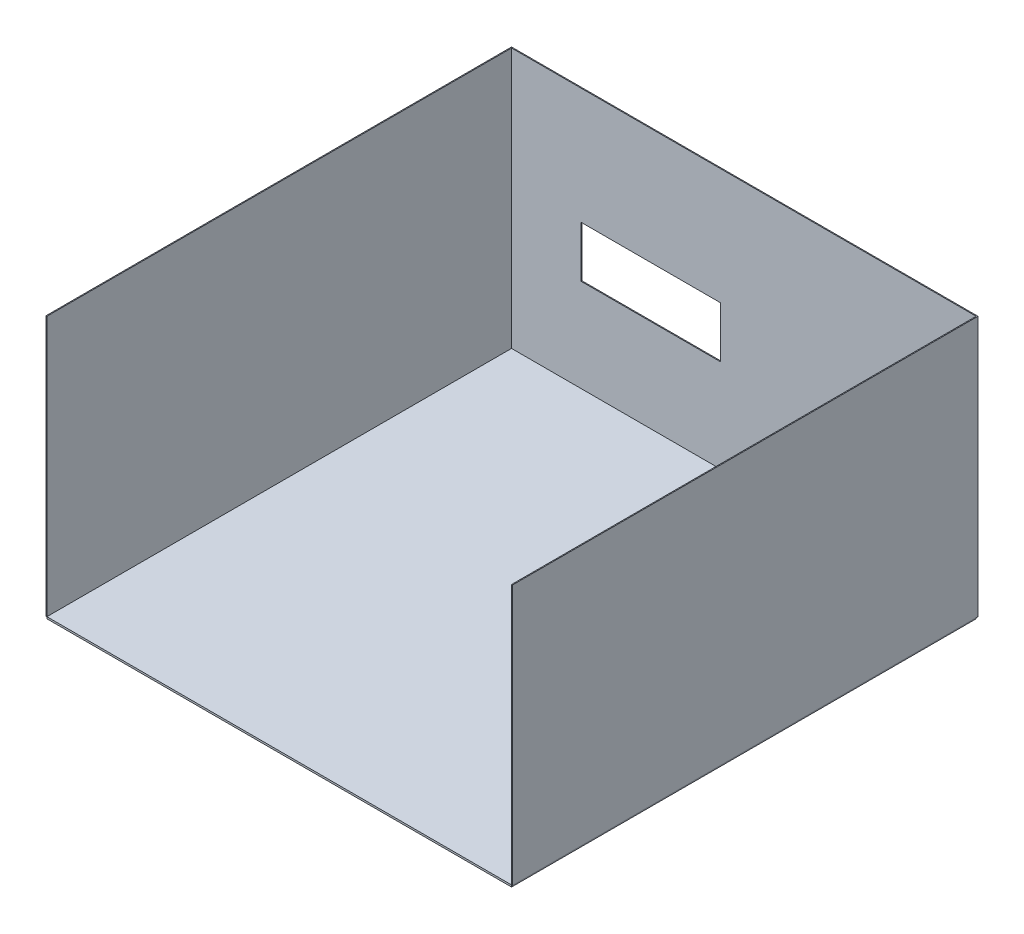
ISO-10303-21;
HEADER;
FILE_DESCRIPTION(('STEP AP214'),'2;1');
FILE_NAME('part.step','',(''),(''),'','','');
FILE_SCHEMA(('AUTOMOTIVE_DESIGN { 1 0 10303 214 1 1 1 1 }'));
ENDSEC;
DATA;
#1=APPLICATION_CONTEXT('core data for automotive mechanical design processes');
#2=APPLICATION_PROTOCOL_DEFINITION('international standard','automotive_design',2000,#1);
#3=PRODUCT_CONTEXT('',#1,'mechanical');
#4=PRODUCT('Part','Part','',(#3));
#5=PRODUCT_RELATED_PRODUCT_CATEGORY('part','',(#4));
#6=PRODUCT_DEFINITION_FORMATION('','',#4);
#7=PRODUCT_DEFINITION_CONTEXT('part definition',#1,'design');
#8=PRODUCT_DEFINITION('design','',#6,#7);
#9=PRODUCT_DEFINITION_SHAPE('','',#8);
#10=(LENGTH_UNIT() NAMED_UNIT(*) SI_UNIT(.MILLI.,.METRE.));
#11=(NAMED_UNIT(*) PLANE_ANGLE_UNIT() SI_UNIT($,.RADIAN.));
#12=(NAMED_UNIT(*) SI_UNIT($,.STERADIAN.) SOLID_ANGLE_UNIT());
#13=UNCERTAINTY_MEASURE_WITH_UNIT(LENGTH_MEASURE(1.E-05),#10,'distance_accuracy_value','');
#14=(GEOMETRIC_REPRESENTATION_CONTEXT(3) GLOBAL_UNCERTAINTY_ASSIGNED_CONTEXT((#13)) GLOBAL_UNIT_ASSIGNED_CONTEXT((#10,
#11,#12)) REPRESENTATION_CONTEXT('',''));
#15=CARTESIAN_POINT('',(0.,0.,0.));
#16=DIRECTION('',(0.,0.,1.));
#17=DIRECTION('',(1.,0.,0.));
#18=AXIS2_PLACEMENT_3D('',#15,#16,#17);
#19=CARTESIAN_POINT('',(-33710.6161425006,2820.,-2909.64545631748));
#20=DIRECTION('',(1.,0.,0.));
#21=DIRECTION('',(0.,0.,-1.));
#22=AXIS2_PLACEMENT_3D('',#19,#20,#21);
#23=PLANE('',#22);
#24=DIRECTION('',(0.,0.,-1.));
#25=VECTOR('',#24,1.);
#26=CARTESIAN_POINT('',(-33710.6161425006,20.,-2909.64545631748));
#27=LINE('',#26,#25);
#28=CARTESIAN_POINT('',(-33710.6161425006,20.,-2919.64545631748));
#29=VERTEX_POINT('',#28);
#30=CARTESIAN_POINT('',(-33710.6161425006,20.,2090.35454368252));
#31=VERTEX_POINT('',#30);
#32=EDGE_CURVE('E169',#29,#31,#27,.F.);
#33=ORIENTED_EDGE('',*,*,#32,.T.);
#34=DIRECTION('',(0.,-1.,0.));
#35=VECTOR('',#34,1.);
#36=CARTESIAN_POINT('',(-33710.6161425006,2820.,2090.35454368252));
#37=LINE('',#36,#35);
#38=CARTESIAN_POINT('',(-33710.6161425006,2820.,2090.35454368252));
#39=VERTEX_POINT('',#38);
#40=EDGE_CURVE('E12',#39,#31,#37,.T.);
#41=ORIENTED_EDGE('',*,*,#40,.F.);
#42=DIRECTION('',(0.,0.,-1.));
#43=VECTOR('',#42,1.);
#44=CARTESIAN_POINT('',(-33710.6161425006,2820.,-2909.64545631748));
#45=LINE('',#44,#43);
#46=CARTESIAN_POINT('',(-33710.6161425006,2820.,-2919.64545631748));
#47=VERTEX_POINT('',#46);
#48=EDGE_CURVE('E173',#47,#39,#45,.F.);
#49=ORIENTED_EDGE('',*,*,#48,.F.);
#50=DIRECTION('',(0.,-1.,0.));
#51=VECTOR('',#50,1.);
#52=CARTESIAN_POINT('',(-33710.6161425006,2820.,-2919.64545631748));
#53=LINE('',#52,#51);
#54=EDGE_CURVE('E195',#47,#29,#53,.T.);
#55=ORIENTED_EDGE('',*,*,#54,.T.);
#56=EDGE_LOOP('',(#33,#41,#49,#55));
#57=FACE_BOUND('',#56,.T.);
#58=ADVANCED_FACE('F49',(#57),#23,.F.);
#59=CARTESIAN_POINT('',(-33700.6161425006,2820.,2090.35454368252));
#60=DIRECTION('',(0.,0.,1.));
#61=DIRECTION('',(1.,0.,0.));
#62=AXIS2_PLACEMENT_3D('',#59,#60,#61);
#63=PLANE('',#62);
#64=DIRECTION('',(-1.,0.,0.));
#65=VECTOR('',#64,1.);
#66=CARTESIAN_POINT('',(-33700.6161425006,20.,2090.35454368252));
#67=LINE('',#66,#65);
#68=CARTESIAN_POINT('',(-33700.6161425006,20.,2090.35454368252));
#69=VERTEX_POINT('',#68);
#70=EDGE_CURVE('E198',#69,#31,#67,.T.);
#71=ORIENTED_EDGE('',*,*,#70,.F.);
#72=DIRECTION('',(0.,-1.,0.));
#73=VECTOR('',#72,1.);
#74=CARTESIAN_POINT('',(-33700.6161425006,2820.,2090.35454368252));
#75=LINE('',#74,#73);
#76=CARTESIAN_POINT('',(-33700.6161425006,2820.,2090.35454368252));
#77=VERTEX_POINT('',#76);
#78=EDGE_CURVE('E56',#77,#69,#75,.T.);
#79=ORIENTED_EDGE('',*,*,#78,.F.);
#80=DIRECTION('',(-1.,0.,0.));
#81=VECTOR('',#80,1.);
#82=CARTESIAN_POINT('',(-33700.6161425006,2820.,2090.35454368252));
#83=LINE('',#82,#81);
#84=EDGE_CURVE('E175',#77,#39,#83,.T.);
#85=ORIENTED_EDGE('',*,*,#84,.T.);
#86=ORIENTED_EDGE('',*,*,#40,.T.);
#87=EDGE_LOOP('',(#71,#79,#85,#86));
#88=FACE_BOUND('',#87,.T.);
#89=ADVANCED_FACE('F235',(#88),#63,.T.);
#90=CARTESIAN_POINT('',(-33700.6161425006,2820.,-2909.64545631748));
#91=DIRECTION('',(1.,0.,0.));
#92=DIRECTION('',(0.,0.,-1.));
#93=AXIS2_PLACEMENT_3D('',#90,#91,#92);
#94=PLANE('',#93);
#95=DIRECTION('',(0.,0.,1.));
#96=VECTOR('',#95,1.);
#97=CARTESIAN_POINT('',(-33700.6161425006,20.,-2909.64545631748));
#98=LINE('',#97,#96);
#99=CARTESIAN_POINT('',(-33700.6161425006,20.,-2909.64545631748));
#100=VERTEX_POINT('',#99);
#101=EDGE_CURVE('E201',#100,#69,#98,.T.);
#102=ORIENTED_EDGE('',*,*,#101,.F.);
#103=DIRECTION('',(0.,-1.,0.));
#104=VECTOR('',#103,1.);
#105=CARTESIAN_POINT('',(-33700.6161425006,2820.,-2909.64545631748));
#106=LINE('',#105,#104);
#107=CARTESIAN_POINT('',(-33700.6161425006,2820.,-2909.64545631748));
#108=VERTEX_POINT('',#107);
#109=EDGE_CURVE('E227',#108,#100,#106,.T.);
#110=ORIENTED_EDGE('',*,*,#109,.F.);
#111=DIRECTION('',(0.,0.,1.));
#112=VECTOR('',#111,1.);
#113=CARTESIAN_POINT('',(-33700.6161425006,2820.,-2909.64545631748));
#114=LINE('',#113,#112);
#115=EDGE_CURVE('E179',#108,#77,#114,.T.);
#116=ORIENTED_EDGE('',*,*,#115,.T.);
#117=ORIENTED_EDGE('',*,*,#78,.T.);
#118=EDGE_LOOP('',(#102,#110,#116,#117));
#119=FACE_BOUND('',#118,.T.);
#120=ADVANCED_FACE('F231',(#119),#94,.T.);
#121=CARTESIAN_POINT('',(-33700.6161425006,2820.,-2909.64545631748));
#122=DIRECTION('',(0.,0.,1.));
#123=DIRECTION('',(1.,0.,0.));
#124=AXIS2_PLACEMENT_3D('',#121,#122,#123);
#125=PLANE('',#124);
#126=DIRECTION('',(0.,-1.,0.));
#127=VECTOR('',#126,1.);
#128=CARTESIAN_POINT('',(-32950.6161425006,1570.,-2909.64545631748));
#129=LINE('',#128,#127);
#130=CARTESIAN_POINT('',(-32950.6161425006,1570.,-2909.64545631748));
#131=VERTEX_POINT('',#130);
#132=CARTESIAN_POINT('',(-32950.6161425006,1020.,-2909.64545631748));
#133=VERTEX_POINT('',#132);
#134=EDGE_CURVE('E63',#131,#133,#129,.T.);
#135=ORIENTED_EDGE('',*,*,#134,.F.);
#136=DIRECTION('',(-1.,0.,0.));
#137=VECTOR('',#136,1.);
#138=CARTESIAN_POINT('',(-32950.6161425006,1570.,-2909.64545631748));
#139=LINE('',#138,#137);
#140=CARTESIAN_POINT('',(-31450.6161425006,1570.,-2909.64545631748));
#141=VERTEX_POINT('',#140);
#142=EDGE_CURVE('E154',#141,#131,#139,.T.);
#143=ORIENTED_EDGE('',*,*,#142,.F.);
#144=DIRECTION('',(0.,1.,0.));
#145=VECTOR('',#144,1.);
#146=CARTESIAN_POINT('',(-31450.6161425006,1570.,-2909.64545631748));
#147=LINE('',#146,#145);
#148=CARTESIAN_POINT('',(-31450.6161425006,1020.,-2909.64545631748));
#149=VERTEX_POINT('',#148);
#150=EDGE_CURVE('E157',#149,#141,#147,.T.);
#151=ORIENTED_EDGE('',*,*,#150,.F.);
#152=DIRECTION('',(1.,0.,0.));
#153=VECTOR('',#152,1.);
#154=CARTESIAN_POINT('',(-32950.6161425006,1020.,-2909.64545631748));
#155=LINE('',#154,#153);
#156=EDGE_CURVE('E163',#133,#149,#155,.T.);
#157=ORIENTED_EDGE('',*,*,#156,.F.);
#158=EDGE_LOOP('',(#135,#143,#151,#157));
#159=FACE_BOUND('',#158,.T.);
#160=DIRECTION('',(-1.,0.,0.));
#161=VECTOR('',#160,1.);
#162=CARTESIAN_POINT('',(-33700.6161425006,20.,-2909.64545631748));
#163=LINE('',#162,#161);
#164=CARTESIAN_POINT('',(-28700.6161425006,20.,-2909.64545631748));
#165=VERTEX_POINT('',#164);
#166=EDGE_CURVE('E204',#165,#100,#163,.T.);
#167=ORIENTED_EDGE('',*,*,#166,.F.);
#168=DIRECTION('',(0.,-1.,0.));
#169=VECTOR('',#168,1.);
#170=CARTESIAN_POINT('',(-28700.6161425006,2820.,-2909.64545631748));
#171=LINE('',#170,#169);
#172=CARTESIAN_POINT('',(-28700.6161425006,2820.,-2909.64545631748));
#173=VERTEX_POINT('',#172);
#174=EDGE_CURVE('E225',#173,#165,#171,.T.);
#175=ORIENTED_EDGE('',*,*,#174,.F.);
#176=DIRECTION('',(-1.,0.,0.));
#177=VECTOR('',#176,1.);
#178=CARTESIAN_POINT('',(-33700.6161425006,2820.,-2909.64545631748));
#179=LINE('',#178,#177);
#180=EDGE_CURVE('E182',#173,#108,#179,.T.);
#181=ORIENTED_EDGE('',*,*,#180,.T.);
#182=ORIENTED_EDGE('',*,*,#109,.T.);
#183=EDGE_LOOP('',(#167,#175,#181,#182));
#184=FACE_BOUND('',#183,.T.);
#185=ADVANCED_FACE('F243',(#159,#184),#125,.T.);
#186=CARTESIAN_POINT('',(-28700.6161425006,2820.,-2909.64545631748));
#187=DIRECTION('',(-1.,0.,0.));
#188=DIRECTION('',(0.,0.,1.));
#189=AXIS2_PLACEMENT_3D('',#186,#187,#188);
#190=PLANE('',#189);
#191=DIRECTION('',(0.,0.,-1.));
#192=VECTOR('',#191,1.);
#193=CARTESIAN_POINT('',(-28700.6161425006,20.,-2909.64545631748));
#194=LINE('',#193,#192);
#195=CARTESIAN_POINT('',(-28700.6161425006,20.,2090.35454368252));
#196=VERTEX_POINT('',#195);
#197=EDGE_CURVE('E207',#196,#165,#194,.T.);
#198=ORIENTED_EDGE('',*,*,#197,.F.);
#199=DIRECTION('',(0.,-1.,0.));
#200=VECTOR('',#199,1.);
#201=CARTESIAN_POINT('',(-28700.6161425006,2820.,2090.35454368252));
#202=LINE('',#201,#200);
#203=CARTESIAN_POINT('',(-28700.6161425006,2820.,2090.35454368252));
#204=VERTEX_POINT('',#203);
#205=EDGE_CURVE('E223',#204,#196,#202,.T.);
#206=ORIENTED_EDGE('',*,*,#205,.F.);
#207=DIRECTION('',(0.,0.,-1.));
#208=VECTOR('',#207,1.);
#209=CARTESIAN_POINT('',(-28700.6161425006,2820.,-2909.64545631748));
#210=LINE('',#209,#208);
#211=EDGE_CURVE('E185',#204,#173,#210,.T.);
#212=ORIENTED_EDGE('',*,*,#211,.T.);
#213=ORIENTED_EDGE('',*,*,#174,.T.);
#214=EDGE_LOOP('',(#198,#206,#212,#213));
#215=FACE_BOUND('',#214,.T.);
#216=ADVANCED_FACE('F263',(#215),#190,.T.);
#217=CARTESIAN_POINT('',(-28690.6161425006,2820.,2090.35454368252));
#218=DIRECTION('',(0.,0.,1.));
#219=DIRECTION('',(1.,0.,0.));
#220=AXIS2_PLACEMENT_3D('',#217,#218,#219);
#221=PLANE('',#220);
#222=DIRECTION('',(-1.,0.,0.));
#223=VECTOR('',#222,1.);
#224=CARTESIAN_POINT('',(-28690.6161425006,20.,2090.35454368252));
#225=LINE('',#224,#223);
#226=CARTESIAN_POINT('',(-28690.6161425006,20.,2090.35454368252));
#227=VERTEX_POINT('',#226);
#228=EDGE_CURVE('E210',#227,#196,#225,.T.);
#229=ORIENTED_EDGE('',*,*,#228,.F.);
#230=DIRECTION('',(0.,-1.,0.));
#231=VECTOR('',#230,1.);
#232=CARTESIAN_POINT('',(-28690.6161425006,2820.,2090.35454368252));
#233=LINE('',#232,#231);
#234=CARTESIAN_POINT('',(-28690.6161425006,2820.,2090.35454368252));
#235=VERTEX_POINT('',#234);
#236=EDGE_CURVE('E221',#235,#227,#233,.T.);
#237=ORIENTED_EDGE('',*,*,#236,.F.);
#238=DIRECTION('',(-1.,0.,0.));
#239=VECTOR('',#238,1.);
#240=CARTESIAN_POINT('',(-28690.6161425006,2820.,2090.35454368252));
#241=LINE('',#240,#239);
#242=EDGE_CURVE('E188',#235,#204,#241,.T.);
#243=ORIENTED_EDGE('',*,*,#242,.T.);
#244=ORIENTED_EDGE('',*,*,#205,.T.);
#245=EDGE_LOOP('',(#229,#237,#243,#244));
#246=FACE_BOUND('',#245,.T.);
#247=ADVANCED_FACE('F261',(#246),#221,.T.);
#248=CARTESIAN_POINT('',(-28690.6161425006,2820.,-2909.64545631748));
#249=DIRECTION('',(-1.,0.,0.));
#250=DIRECTION('',(0.,0.,1.));
#251=AXIS2_PLACEMENT_3D('',#248,#249,#250);
#252=PLANE('',#251);
#253=DIRECTION('',(0.,0.,-1.));
#254=VECTOR('',#253,1.);
#255=CARTESIAN_POINT('',(-28690.6161425006,20.,-2909.64545631748));
#256=LINE('',#255,#254);
#257=CARTESIAN_POINT('',(-28690.6161425006,20.,-2919.64545631748));
#258=VERTEX_POINT('',#257);
#259=EDGE_CURVE('E213',#227,#258,#256,.T.);
#260=ORIENTED_EDGE('',*,*,#259,.T.);
#261=DIRECTION('',(0.,-1.,0.));
#262=VECTOR('',#261,1.);
#263=CARTESIAN_POINT('',(-28690.6161425006,2820.,-2919.64545631748));
#264=LINE('',#263,#262);
#265=CARTESIAN_POINT('',(-28690.6161425006,2820.,-2919.64545631748));
#266=VERTEX_POINT('',#265);
#267=EDGE_CURVE('E218',#266,#258,#264,.T.);
#268=ORIENTED_EDGE('',*,*,#267,.F.);
#269=DIRECTION('',(0.,0.,-1.));
#270=VECTOR('',#269,1.);
#271=CARTESIAN_POINT('',(-28690.6161425006,2820.,-2909.64545631748));
#272=LINE('',#271,#270);
#273=EDGE_CURVE('E191',#235,#266,#272,.T.);
#274=ORIENTED_EDGE('',*,*,#273,.F.);
#275=ORIENTED_EDGE('',*,*,#236,.T.);
#276=EDGE_LOOP('',(#260,#268,#274,#275));
#277=FACE_BOUND('',#276,.T.);
#278=ADVANCED_FACE('F258',(#277),#252,.F.);
#279=CARTESIAN_POINT('',(-33700.6161425006,2820.,-2919.64545631748));
#280=DIRECTION('',(0.,0.,1.));
#281=DIRECTION('',(1.,0.,0.));
#282=AXIS2_PLACEMENT_3D('',#279,#280,#281);
#283=PLANE('',#282);
#284=DIRECTION('',(-1.,0.,0.));
#285=VECTOR('',#284,1.);
#286=CARTESIAN_POINT('',(-32950.6161425006,1570.,-2919.64545631748));
#287=LINE('',#286,#285);
#288=CARTESIAN_POINT('',(-31450.6161425006,1570.,-2919.64545631748));
#289=VERTEX_POINT('',#288);
#290=CARTESIAN_POINT('',(-32950.6161425006,1570.,-2919.64545631748));
#291=VERTEX_POINT('',#290);
#292=EDGE_CURVE('E144',#289,#291,#287,.T.);
#293=ORIENTED_EDGE('',*,*,#292,.T.);
#294=DIRECTION('',(0.,-1.,0.));
#295=VECTOR('',#294,1.);
#296=CARTESIAN_POINT('',(-32950.6161425006,1570.,-2919.64545631748));
#297=LINE('',#296,#295);
#298=CARTESIAN_POINT('',(-32950.6161425006,1020.,-2919.64545631748));
#299=VERTEX_POINT('',#298);
#300=EDGE_CURVE('E138',#291,#299,#297,.T.);
#301=ORIENTED_EDGE('',*,*,#300,.T.);
#302=DIRECTION('',(1.,0.,0.));
#303=VECTOR('',#302,1.);
#304=CARTESIAN_POINT('',(-32950.6161425006,1020.,-2919.64545631748));
#305=LINE('',#304,#303);
#306=CARTESIAN_POINT('',(-31450.6161425006,1020.,-2919.64545631748));
#307=VERTEX_POINT('',#306);
#308=EDGE_CURVE('E147',#299,#307,#305,.T.);
#309=ORIENTED_EDGE('',*,*,#308,.T.);
#310=DIRECTION('',(0.,1.,0.));
#311=VECTOR('',#310,1.);
#312=CARTESIAN_POINT('',(-31450.6161425006,1570.,-2919.64545631748));
#313=LINE('',#312,#311);
#314=EDGE_CURVE('E71',#307,#289,#313,.T.);
#315=ORIENTED_EDGE('',*,*,#314,.T.);
#316=EDGE_LOOP('',(#293,#301,#309,#315));
#317=FACE_BOUND('',#316,.T.);
#318=DIRECTION('',(1.,0.,0.));
#319=VECTOR('',#318,1.);
#320=CARTESIAN_POINT('',(-33700.6161425006,20.,-2919.64545631748));
#321=LINE('',#320,#319);
#322=EDGE_CURVE('E176',#258,#29,#321,.F.);
#323=ORIENTED_EDGE('',*,*,#322,.T.);
#324=ORIENTED_EDGE('',*,*,#54,.F.);
#325=DIRECTION('',(1.,0.,0.));
#326=VECTOR('',#325,1.);
#327=CARTESIAN_POINT('',(-33700.6161425006,2820.,-2919.64545631748));
#328=LINE('',#327,#326);
#329=EDGE_CURVE('E193',#266,#47,#328,.F.);
#330=ORIENTED_EDGE('',*,*,#329,.F.);
#331=ORIENTED_EDGE('',*,*,#267,.T.);
#332=EDGE_LOOP('',(#323,#324,#330,#331));
#333=FACE_BOUND('',#332,.T.);
#334=ADVANCED_FACE('F151',(#317,#333),#283,.F.);
#335=CARTESIAN_POINT('',(0.,2820.,0.));
#336=DIRECTION('',(0.,1.,0.));
#337=DIRECTION('',(1.,0.,0.));
#338=AXIS2_PLACEMENT_3D('',#335,#336,#337);
#339=PLANE('',#338);
#340=ORIENTED_EDGE('',*,*,#48,.T.);
#341=ORIENTED_EDGE('',*,*,#84,.F.);
#342=ORIENTED_EDGE('',*,*,#115,.F.);
#343=ORIENTED_EDGE('',*,*,#180,.F.);
#344=ORIENTED_EDGE('',*,*,#211,.F.);
#345=ORIENTED_EDGE('',*,*,#242,.F.);
#346=ORIENTED_EDGE('',*,*,#273,.T.);
#347=ORIENTED_EDGE('',*,*,#329,.T.);
#348=EDGE_LOOP('',(#340,#341,#342,#343,#344,#345,#346,#347));
#349=FACE_BOUND('',#348,.T.);
#350=ADVANCED_FACE('F246',(#349),#339,.T.);
#351=CARTESIAN_POINT('',(0.,20.,0.));
#352=DIRECTION('',(0.,1.,0.));
#353=DIRECTION('',(1.,0.,0.));
#354=AXIS2_PLACEMENT_3D('',#351,#352,#353);
#355=PLANE('',#354);
#356=ORIENTED_EDGE('',*,*,#32,.F.);
#357=ORIENTED_EDGE('',*,*,#322,.F.);
#358=ORIENTED_EDGE('',*,*,#259,.F.);
#359=ORIENTED_EDGE('',*,*,#228,.T.);
#360=ORIENTED_EDGE('',*,*,#197,.T.);
#361=ORIENTED_EDGE('',*,*,#166,.T.);
#362=ORIENTED_EDGE('',*,*,#101,.T.);
#363=ORIENTED_EDGE('',*,*,#70,.T.);
#364=EDGE_LOOP('',(#356,#357,#358,#359,#360,#361,#362,#363));
#365=FACE_BOUND('',#364,.T.);
#366=ADVANCED_FACE('F239',(#365),#355,.F.);
#367=CARTESIAN_POINT('',(-32950.6161425006,1570.,-2919.64545631748));
#368=DIRECTION('',(-1.,0.,0.));
#369=DIRECTION('',(0.,0.,1.));
#370=AXIS2_PLACEMENT_3D('',#367,#368,#369);
#371=PLANE('',#370);
#372=ORIENTED_EDGE('',*,*,#134,.T.);
#373=DIRECTION('',(0.,0.,1.));
#374=VECTOR('',#373,1.);
#375=CARTESIAN_POINT('',(-32950.6161425006,1020.,-2919.64545631748));
#376=LINE('',#375,#374);
#377=EDGE_CURVE('E134',#299,#133,#376,.T.);
#378=ORIENTED_EDGE('',*,*,#377,.F.);
#379=ORIENTED_EDGE('',*,*,#300,.F.);
#380=DIRECTION('',(0.,0.,1.));
#381=VECTOR('',#380,1.);
#382=CARTESIAN_POINT('',(-32950.6161425006,1570.,-2919.64545631748));
#383=LINE('',#382,#381);
#384=EDGE_CURVE('E167',#291,#131,#383,.T.);
#385=ORIENTED_EDGE('',*,*,#384,.T.);
#386=EDGE_LOOP('',(#372,#378,#379,#385));
#387=FACE_BOUND('',#386,.T.);
#388=ADVANCED_FACE('F136',(#387),#371,.F.);
#389=CARTESIAN_POINT('',(-32950.6161425006,1570.,-2919.64545631748));
#390=DIRECTION('',(0.,1.,0.));
#391=DIRECTION('',(0.,0.,1.));
#392=AXIS2_PLACEMENT_3D('',#389,#390,#391);
#393=PLANE('',#392);
#394=ORIENTED_EDGE('',*,*,#142,.T.);
#395=ORIENTED_EDGE('',*,*,#384,.F.);
#396=ORIENTED_EDGE('',*,*,#292,.F.);
#397=DIRECTION('',(0.,0.,1.));
#398=VECTOR('',#397,1.);
#399=CARTESIAN_POINT('',(-31450.6161425006,1570.,-2919.64545631748));
#400=LINE('',#399,#398);
#401=EDGE_CURVE('E170',#289,#141,#400,.T.);
#402=ORIENTED_EDGE('',*,*,#401,.T.);
#403=EDGE_LOOP('',(#394,#395,#396,#402));
#404=FACE_BOUND('',#403,.T.);
#405=ADVANCED_FACE('F316',(#404),#393,.F.);
#406=CARTESIAN_POINT('',(-31450.6161425006,1570.,-2919.64545631748));
#407=DIRECTION('',(1.,0.,0.));
#408=DIRECTION('',(0.,0.,-1.));
#409=AXIS2_PLACEMENT_3D('',#406,#407,#408);
#410=PLANE('',#409);
#411=ORIENTED_EDGE('',*,*,#150,.T.);
#412=ORIENTED_EDGE('',*,*,#401,.F.);
#413=ORIENTED_EDGE('',*,*,#314,.F.);
#414=DIRECTION('',(0.,0.,1.));
#415=VECTOR('',#414,1.);
#416=CARTESIAN_POINT('',(-31450.6161425006,1020.,-2919.64545631748));
#417=LINE('',#416,#415);
#418=EDGE_CURVE('E143',#307,#149,#417,.T.);
#419=ORIENTED_EDGE('',*,*,#418,.T.);
#420=EDGE_LOOP('',(#411,#412,#413,#419));
#421=FACE_BOUND('',#420,.T.);
#422=ADVANCED_FACE('F326',(#421),#410,.F.);
#423=CARTESIAN_POINT('',(-32950.6161425006,1020.,-2919.64545631748));
#424=DIRECTION('',(0.,-1.,0.));
#425=DIRECTION('',(0.,0.,-1.));
#426=AXIS2_PLACEMENT_3D('',#423,#424,#425);
#427=PLANE('',#426);
#428=ORIENTED_EDGE('',*,*,#156,.T.);
#429=ORIENTED_EDGE('',*,*,#418,.F.);
#430=ORIENTED_EDGE('',*,*,#308,.F.);
#431=ORIENTED_EDGE('',*,*,#377,.T.);
#432=EDGE_LOOP('',(#428,#429,#430,#431));
#433=FACE_BOUND('',#432,.T.);
#434=ADVANCED_FACE('F148',(#433),#427,.F.);
#435=CLOSED_SHELL('',(#58,#89,#120,#185,#216,#247,#278,#334,#350,#366,#388,#405,#422,#434));
#436=MANIFOLD_SOLID_BREP('B2',#435);
#437=CARTESIAN_POINT('',(-33700.6161425006,20.,2090.35454368252));
#438=DIRECTION('',(0.,0.,-1.));
#439=DIRECTION('',(-1.,0.,0.));
#440=AXIS2_PLACEMENT_3D('',#437,#438,#439);
#441=PLANE('',#440);
#442=DIRECTION('',(1.,0.,0.));
#443=VECTOR('',#442,1.);
#444=CARTESIAN_POINT('',(-33700.6161425006,0.,2090.35454368252));
#445=LINE('',#444,#443);
#446=CARTESIAN_POINT('',(-33700.6161425006,0.,2090.35454368252));
#447=VERTEX_POINT('',#446);
#448=CARTESIAN_POINT('',(-28700.6161425006,0.,2090.35454368252));
#449=VERTEX_POINT('',#448);
#450=EDGE_CURVE('E479',#447,#449,#445,.T.);
#451=ORIENTED_EDGE('',*,*,#450,.T.);
#452=DIRECTION('',(0.,-1.,0.));
#453=VECTOR('',#452,1.);
#454=CARTESIAN_POINT('',(-28700.6161425006,20.,2090.35454368252));
#455=LINE('',#454,#453);
#456=CARTESIAN_POINT('',(-28700.6161425006,20.,2090.35454368252));
#457=VERTEX_POINT('',#456);
#458=EDGE_CURVE('E47',#457,#449,#455,.T.);
#459=ORIENTED_EDGE('',*,*,#458,.F.);
#460=DIRECTION('',(1.,0.,0.));
#461=VECTOR('',#460,1.);
#462=CARTESIAN_POINT('',(-33700.6161425006,20.,2090.35454368252));
#463=LINE('',#462,#461);
#464=CARTESIAN_POINT('',(-33700.6161425006,20.,2090.35454368252));
#465=VERTEX_POINT('',#464);
#466=EDGE_CURVE('E456',#465,#457,#463,.T.);
#467=ORIENTED_EDGE('',*,*,#466,.F.);
#468=DIRECTION('',(0.,-1.,0.));
#469=VECTOR('',#468,1.);
#470=CARTESIAN_POINT('',(-33700.6161425006,20.,2090.35454368252));
#471=LINE('',#470,#469);
#472=EDGE_CURVE('E475',#465,#447,#471,.T.);
#473=ORIENTED_EDGE('',*,*,#472,.T.);
#474=EDGE_LOOP('',(#451,#459,#467,#473));
#475=FACE_BOUND('',#474,.T.);
#476=ADVANCED_FACE('F417',(#475),#441,.F.);
#477=CARTESIAN_POINT('',(-28700.6161425006,20.,-2909.64545631748));
#478=DIRECTION('',(1.,0.,0.));
#479=DIRECTION('',(0.,0.,-1.));
#480=AXIS2_PLACEMENT_3D('',#477,#478,#479);
#481=PLANE('',#480);
#482=DIRECTION('',(0.,0.,1.));
#483=VECTOR('',#482,1.);
#484=CARTESIAN_POINT('',(-28700.6161425006,0.,-2909.64545631748));
#485=LINE('',#484,#483);
#486=CARTESIAN_POINT('',(-28700.6161425006,0.,-2909.64545631748));
#487=VERTEX_POINT('',#486);
#488=EDGE_CURVE('E465',#487,#449,#485,.T.);
#489=ORIENTED_EDGE('',*,*,#488,.F.);
#490=DIRECTION('',(0.,-1.,0.));
#491=VECTOR('',#490,1.);
#492=CARTESIAN_POINT('',(-28700.6161425006,20.,-2909.64545631748));
#493=LINE('',#492,#491);
#494=CARTESIAN_POINT('',(-28700.6161425006,20.,-2909.64545631748));
#495=VERTEX_POINT('',#494);
#496=EDGE_CURVE('E425',#495,#487,#493,.T.);
#497=ORIENTED_EDGE('',*,*,#496,.F.);
#498=DIRECTION('',(0.,0.,1.));
#499=VECTOR('',#498,1.);
#500=CARTESIAN_POINT('',(-28700.6161425006,20.,-2909.64545631748));
#501=LINE('',#500,#499);
#502=EDGE_CURVE('E463',#495,#457,#501,.T.);
#503=ORIENTED_EDGE('',*,*,#502,.T.);
#504=ORIENTED_EDGE('',*,*,#458,.T.);
#505=EDGE_LOOP('',(#489,#497,#503,#504));
#506=FACE_BOUND('',#505,.T.);
#507=ADVANCED_FACE('F462',(#506),#481,.T.);
#508=CARTESIAN_POINT('',(-33700.6161425006,20.,-2909.64545631748));
#509=DIRECTION('',(0.,0.,-1.));
#510=DIRECTION('',(-1.,0.,0.));
#511=AXIS2_PLACEMENT_3D('',#508,#509,#510);
#512=PLANE('',#511);
#513=DIRECTION('',(1.,0.,0.));
#514=VECTOR('',#513,1.);
#515=CARTESIAN_POINT('',(-33700.6161425006,0.,-2909.64545631748));
#516=LINE('',#515,#514);
#517=CARTESIAN_POINT('',(-33700.6161425006,0.,-2909.64545631748));
#518=VERTEX_POINT('',#517);
#519=EDGE_CURVE('E483',#518,#487,#516,.T.);
#520=ORIENTED_EDGE('',*,*,#519,.F.);
#521=DIRECTION('',(0.,-1.,0.));
#522=VECTOR('',#521,1.);
#523=CARTESIAN_POINT('',(-33700.6161425006,20.,-2909.64545631748));
#524=LINE('',#523,#522);
#525=CARTESIAN_POINT('',(-33700.6161425006,20.,-2909.64545631748));
#526=VERTEX_POINT('',#525);
#527=EDGE_CURVE('E448',#526,#518,#524,.T.);
#528=ORIENTED_EDGE('',*,*,#527,.F.);
#529=DIRECTION('',(1.,0.,0.));
#530=VECTOR('',#529,1.);
#531=CARTESIAN_POINT('',(-33700.6161425006,20.,-2909.64545631748));
#532=LINE('',#531,#530);
#533=EDGE_CURVE('E471',#526,#495,#532,.T.);
#534=ORIENTED_EDGE('',*,*,#533,.T.);
#535=ORIENTED_EDGE('',*,*,#496,.T.);
#536=EDGE_LOOP('',(#520,#528,#534,#535));
#537=FACE_BOUND('',#536,.T.);
#538=ADVANCED_FACE('F473',(#537),#512,.T.);
#539=CARTESIAN_POINT('',(-33700.6161425006,20.,-2909.64545631748));
#540=DIRECTION('',(1.,0.,0.));
#541=DIRECTION('',(0.,0.,-1.));
#542=AXIS2_PLACEMENT_3D('',#539,#540,#541);
#543=PLANE('',#542);
#544=DIRECTION('',(0.,0.,1.));
#545=VECTOR('',#544,1.);
#546=CARTESIAN_POINT('',(-33700.6161425006,0.,-2909.64545631748));
#547=LINE('',#546,#545);
#548=EDGE_CURVE('E451',#518,#447,#547,.T.);
#549=ORIENTED_EDGE('',*,*,#548,.T.);
#550=ORIENTED_EDGE('',*,*,#472,.F.);
#551=DIRECTION('',(0.,0.,1.));
#552=VECTOR('',#551,1.);
#553=CARTESIAN_POINT('',(-33700.6161425006,20.,-2909.64545631748));
#554=LINE('',#553,#552);
#555=EDGE_CURVE('E433',#526,#465,#554,.T.);
#556=ORIENTED_EDGE('',*,*,#555,.F.);
#557=ORIENTED_EDGE('',*,*,#527,.T.);
#558=EDGE_LOOP('',(#549,#550,#556,#557));
#559=FACE_BOUND('',#558,.T.);
#560=ADVANCED_FACE('F496',(#559),#543,.F.);
#561=CARTESIAN_POINT('',(0.,20.,0.));
#562=DIRECTION('',(0.,-1.,0.));
#563=DIRECTION('',(0.,0.,-1.));
#564=AXIS2_PLACEMENT_3D('',#561,#562,#563);
#565=PLANE('',#564);
#566=ORIENTED_EDGE('',*,*,#466,.T.);
#567=ORIENTED_EDGE('',*,*,#502,.F.);
#568=ORIENTED_EDGE('',*,*,#533,.F.);
#569=ORIENTED_EDGE('',*,*,#555,.T.);
#570=EDGE_LOOP('',(#566,#567,#568,#569));
#571=FACE_BOUND('',#570,.T.);
#572=ADVANCED_FACE('F470',(#571),#565,.F.);
#573=CARTESIAN_POINT('',(0.,0.,0.));
#574=DIRECTION('',(0.,-1.,0.));
#575=DIRECTION('',(0.,0.,-1.));
#576=AXIS2_PLACEMENT_3D('',#573,#574,#575);
#577=PLANE('',#576);
#578=ORIENTED_EDGE('',*,*,#450,.F.);
#579=ORIENTED_EDGE('',*,*,#548,.F.);
#580=ORIENTED_EDGE('',*,*,#519,.T.);
#581=ORIENTED_EDGE('',*,*,#488,.T.);
#582=EDGE_LOOP('',(#578,#579,#580,#581));
#583=FACE_BOUND('',#582,.T.);
#584=ADVANCED_FACE('F490',(#583),#577,.T.);
#585=CLOSED_SHELL('',(#476,#507,#538,#560,#572,#584));
#586=MANIFOLD_SOLID_BREP('B6',#585);
#587=ADVANCED_BREP_SHAPE_REPRESENTATION('',(#18,#436,#586),#14);
#588=SHAPE_DEFINITION_REPRESENTATION(#9,#587);
ENDSEC;
END-ISO-10303-21;
